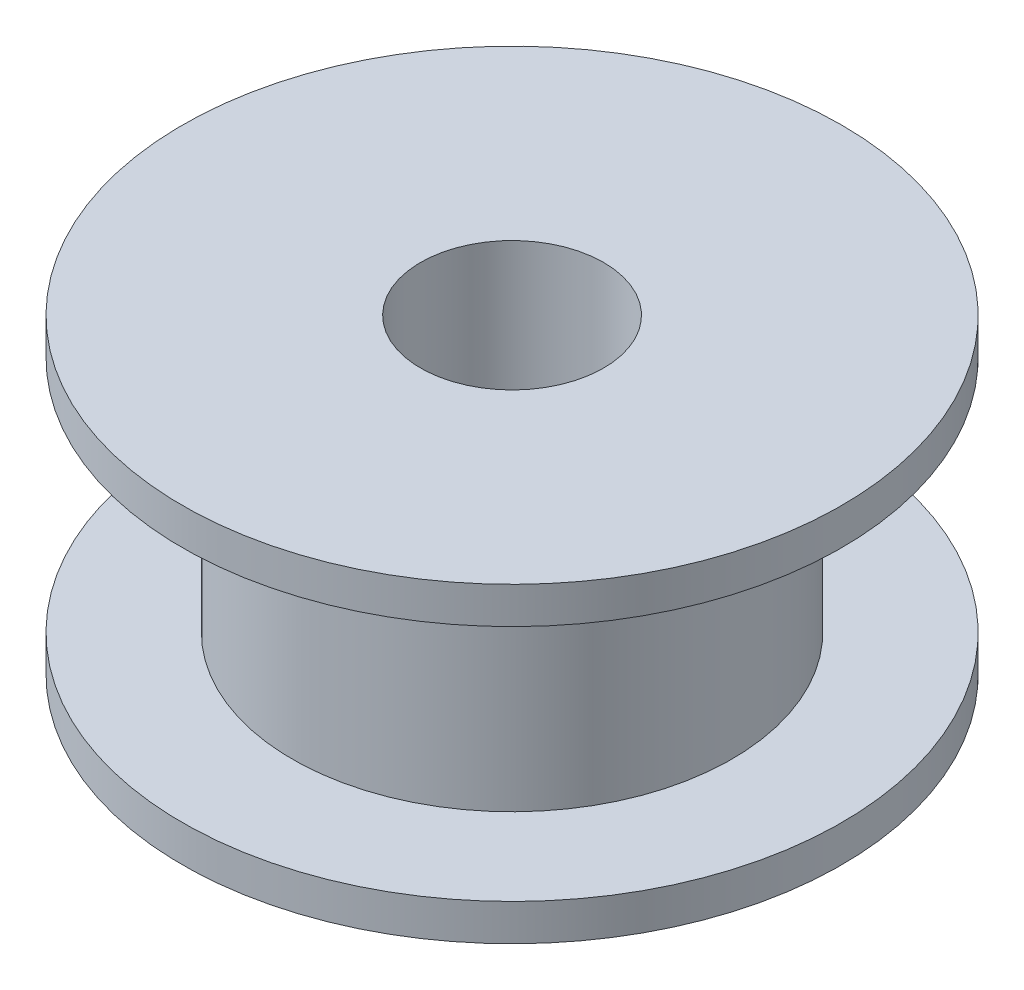
ISO-10303-21;
HEADER;
FILE_DESCRIPTION(('STEP AP214'),'2;1');
FILE_NAME('part.step','',(''),(''),'','','');
FILE_SCHEMA(('AUTOMOTIVE_DESIGN { 1 0 10303 214 1 1 1 1 }'));
ENDSEC;
DATA;
#1=APPLICATION_CONTEXT('core data for automotive mechanical design processes');
#2=APPLICATION_PROTOCOL_DEFINITION('international standard','automotive_design',2000,#1);
#3=PRODUCT_CONTEXT('',#1,'mechanical');
#4=PRODUCT('Part','Part','',(#3));
#5=PRODUCT_RELATED_PRODUCT_CATEGORY('part','',(#4));
#6=PRODUCT_DEFINITION_FORMATION('','',#4);
#7=PRODUCT_DEFINITION_CONTEXT('part definition',#1,'design');
#8=PRODUCT_DEFINITION('design','',#6,#7);
#9=PRODUCT_DEFINITION_SHAPE('','',#8);
#10=(LENGTH_UNIT() NAMED_UNIT(*) SI_UNIT(.MILLI.,.METRE.));
#11=(NAMED_UNIT(*) PLANE_ANGLE_UNIT() SI_UNIT($,.RADIAN.));
#12=(NAMED_UNIT(*) SI_UNIT($,.STERADIAN.) SOLID_ANGLE_UNIT());
#13=UNCERTAINTY_MEASURE_WITH_UNIT(LENGTH_MEASURE(1.E-05),#10,'distance_accuracy_value','');
#14=(GEOMETRIC_REPRESENTATION_CONTEXT(3) GLOBAL_UNCERTAINTY_ASSIGNED_CONTEXT((#13)) GLOBAL_UNIT_ASSIGNED_CONTEXT((#10,
#11,#12)) REPRESENTATION_CONTEXT('',''));
#15=CARTESIAN_POINT('',(0.,0.,0.));
#16=DIRECTION('',(0.,0.,1.));
#17=DIRECTION('',(1.,0.,0.));
#18=AXIS2_PLACEMENT_3D('',#15,#16,#17);
#19=CARTESIAN_POINT('',(0.,0.,0.));
#20=DIRECTION('',(0.,-1.,0.));
#21=DIRECTION('',(0.,0.,-1.));
#22=AXIS2_PLACEMENT_3D('',#19,#20,#21);
#23=CYLINDRICAL_SURFACE('',#22,2.5);
#24=CARTESIAN_POINT('',(0.,8.5,0.));
#25=DIRECTION('',(0.,-1.,0.));
#26=DIRECTION('',(0.,0.,-1.));
#27=AXIS2_PLACEMENT_3D('',#24,#25,#26);
#28=CIRCLE('',#27,2.5);
#29=CARTESIAN_POINT('',(0.,8.5,-2.5));
#30=VERTEX_POINT('',#29);
#31=EDGE_CURVE('E10',#30,#30,#28,.T.);
#32=ORIENTED_EDGE('',*,*,#31,.F.);
#33=EDGE_LOOP('',(#32));
#34=FACE_BOUND('',#33,.T.);
#35=CARTESIAN_POINT('',(0.,0.,0.));
#36=DIRECTION('',(0.,-1.,0.));
#37=DIRECTION('',(0.,0.,-1.));
#38=AXIS2_PLACEMENT_3D('',#35,#36,#37);
#39=CIRCLE('',#38,2.5);
#40=CARTESIAN_POINT('',(0.,0.,-2.5));
#41=VERTEX_POINT('',#40);
#42=EDGE_CURVE('E65',#41,#41,#39,.T.);
#43=ORIENTED_EDGE('',*,*,#42,.T.);
#44=EDGE_LOOP('',(#43));
#45=FACE_BOUND('',#44,.T.);
#46=ADVANCED_FACE('F37',(#34,#45),#23,.F.);
#47=CARTESIAN_POINT('',(-6.,8.5,0.));
#48=DIRECTION('',(0.,-1.,0.));
#49=DIRECTION('',(0.,0.,-1.));
#50=AXIS2_PLACEMENT_3D('',#47,#48,#49);
#51=PLANE('',#50);
#52=CARTESIAN_POINT('',(0.,8.5,0.));
#53=DIRECTION('',(0.,-1.,0.));
#54=DIRECTION('',(0.,0.,-1.));
#55=AXIS2_PLACEMENT_3D('',#52,#53,#54);
#56=CIRCLE('',#55,9.);
#57=CARTESIAN_POINT('',(0.,8.5,-9.));
#58=VERTEX_POINT('',#57);
#59=EDGE_CURVE('E43',#58,#58,#56,.T.);
#60=ORIENTED_EDGE('',*,*,#59,.F.);
#61=EDGE_LOOP('',(#60));
#62=FACE_BOUND('',#61,.T.);
#63=ORIENTED_EDGE('',*,*,#31,.T.);
#64=EDGE_LOOP('',(#63));
#65=FACE_BOUND('',#64,.T.);
#66=ADVANCED_FACE('F102',(#62,#65),#51,.F.);
#67=CARTESIAN_POINT('',(0.,0.,0.));
#68=DIRECTION('',(0.,-1.,0.));
#69=DIRECTION('',(0.,0.,-1.));
#70=AXIS2_PLACEMENT_3D('',#67,#68,#69);
#71=CYLINDRICAL_SURFACE('',#70,9.);
#72=CARTESIAN_POINT('',(0.,7.5,0.));
#73=DIRECTION('',(0.,-1.,0.));
#74=DIRECTION('',(0.,0.,-1.));
#75=AXIS2_PLACEMENT_3D('',#72,#73,#74);
#76=CIRCLE('',#75,9.);
#77=CARTESIAN_POINT('',(0.,7.5,-9.));
#78=VERTEX_POINT('',#77);
#79=EDGE_CURVE('E47',#78,#78,#76,.T.);
#80=ORIENTED_EDGE('',*,*,#79,.F.);
#81=EDGE_LOOP('',(#80));
#82=FACE_BOUND('',#81,.T.);
#83=ORIENTED_EDGE('',*,*,#59,.T.);
#84=EDGE_LOOP('',(#83));
#85=FACE_BOUND('',#84,.T.);
#86=ADVANCED_FACE('F97',(#82,#85),#71,.T.);
#87=CARTESIAN_POINT('',(-6.,7.5,0.));
#88=DIRECTION('',(0.,1.,0.));
#89=DIRECTION('',(0.,0.,1.));
#90=AXIS2_PLACEMENT_3D('',#87,#88,#89);
#91=PLANE('',#90);
#92=CARTESIAN_POINT('',(0.,7.5,0.));
#93=DIRECTION('',(0.,-1.,0.));
#94=DIRECTION('',(0.,0.,-1.));
#95=AXIS2_PLACEMENT_3D('',#92,#93,#94);
#96=CIRCLE('',#95,6.);
#97=CARTESIAN_POINT('',(0.,7.5,-6.));
#98=VERTEX_POINT('',#97);
#99=EDGE_CURVE('E51',#98,#98,#96,.T.);
#100=ORIENTED_EDGE('',*,*,#99,.F.);
#101=EDGE_LOOP('',(#100));
#102=FACE_BOUND('',#101,.T.);
#103=ORIENTED_EDGE('',*,*,#79,.T.);
#104=EDGE_LOOP('',(#103));
#105=FACE_BOUND('',#104,.T.);
#106=ADVANCED_FACE('F91',(#102,#105),#91,.F.);
#107=CARTESIAN_POINT('',(0.,0.,0.));
#108=DIRECTION('',(0.,-1.,0.));
#109=DIRECTION('',(0.,0.,-1.));
#110=AXIS2_PLACEMENT_3D('',#107,#108,#109);
#111=CYLINDRICAL_SURFACE('',#110,6.);
#112=CARTESIAN_POINT('',(0.,1.,0.));
#113=DIRECTION('',(0.,-1.,0.));
#114=DIRECTION('',(0.,0.,-1.));
#115=AXIS2_PLACEMENT_3D('',#112,#113,#114);
#116=CIRCLE('',#115,6.);
#117=CARTESIAN_POINT('',(0.,1.,-6.));
#118=VERTEX_POINT('',#117);
#119=EDGE_CURVE('E56',#118,#118,#116,.T.);
#120=ORIENTED_EDGE('',*,*,#119,.F.);
#121=EDGE_LOOP('',(#120));
#122=FACE_BOUND('',#121,.T.);
#123=ORIENTED_EDGE('',*,*,#99,.T.);
#124=EDGE_LOOP('',(#123));
#125=FACE_BOUND('',#124,.T.);
#126=ADVANCED_FACE('F85',(#122,#125),#111,.T.);
#127=CARTESIAN_POINT('',(-6.,1.,0.));
#128=DIRECTION('',(0.,-1.,0.));
#129=DIRECTION('',(0.,0.,-1.));
#130=AXIS2_PLACEMENT_3D('',#127,#128,#129);
#131=PLANE('',#130);
#132=CARTESIAN_POINT('',(0.,1.,0.));
#133=DIRECTION('',(0.,-1.,0.));
#134=DIRECTION('',(0.,0.,-1.));
#135=AXIS2_PLACEMENT_3D('',#132,#133,#134);
#136=CIRCLE('',#135,9.);
#137=CARTESIAN_POINT('',(0.,1.,-9.));
#138=VERTEX_POINT('',#137);
#139=EDGE_CURVE('E59',#138,#138,#136,.T.);
#140=ORIENTED_EDGE('',*,*,#139,.F.);
#141=EDGE_LOOP('',(#140));
#142=FACE_BOUND('',#141,.T.);
#143=ORIENTED_EDGE('',*,*,#119,.T.);
#144=EDGE_LOOP('',(#143));
#145=FACE_BOUND('',#144,.T.);
#146=ADVANCED_FACE('F79',(#142,#145),#131,.F.);
#147=CARTESIAN_POINT('',(0.,0.,0.));
#148=DIRECTION('',(0.,-1.,0.));
#149=DIRECTION('',(0.,0.,-1.));
#150=AXIS2_PLACEMENT_3D('',#147,#148,#149);
#151=CYLINDRICAL_SURFACE('',#150,9.);
#152=CARTESIAN_POINT('',(0.,0.,0.));
#153=DIRECTION('',(0.,-1.,0.));
#154=DIRECTION('',(0.,0.,-1.));
#155=AXIS2_PLACEMENT_3D('',#152,#153,#154);
#156=CIRCLE('',#155,9.);
#157=CARTESIAN_POINT('',(0.,0.,-9.));
#158=VERTEX_POINT('',#157);
#159=EDGE_CURVE('E62',#158,#158,#156,.T.);
#160=ORIENTED_EDGE('',*,*,#159,.F.);
#161=EDGE_LOOP('',(#160));
#162=FACE_BOUND('',#161,.T.);
#163=ORIENTED_EDGE('',*,*,#139,.T.);
#164=EDGE_LOOP('',(#163));
#165=FACE_BOUND('',#164,.T.);
#166=ADVANCED_FACE('F73',(#162,#165),#151,.T.);
#167=CARTESIAN_POINT('',(-2.5,0.,0.));
#168=DIRECTION('',(0.,1.,0.));
#169=DIRECTION('',(0.,0.,1.));
#170=AXIS2_PLACEMENT_3D('',#167,#168,#169);
#171=PLANE('',#170);
#172=ORIENTED_EDGE('',*,*,#42,.F.);
#173=EDGE_LOOP('',(#172));
#174=FACE_BOUND('',#173,.T.);
#175=ORIENTED_EDGE('',*,*,#159,.T.);
#176=EDGE_LOOP('',(#175));
#177=FACE_BOUND('',#176,.T.);
#178=ADVANCED_FACE('F70',(#174,#177),#171,.F.);
#179=CLOSED_SHELL('',(#46,#66,#86,#106,#126,#146,#166,#178));
#180=MANIFOLD_SOLID_BREP('B2',#179);
#181=ADVANCED_BREP_SHAPE_REPRESENTATION('',(#18,#180),#14);
#182=SHAPE_DEFINITION_REPRESENTATION(#9,#181);
ENDSEC;
END-ISO-10303-21;
